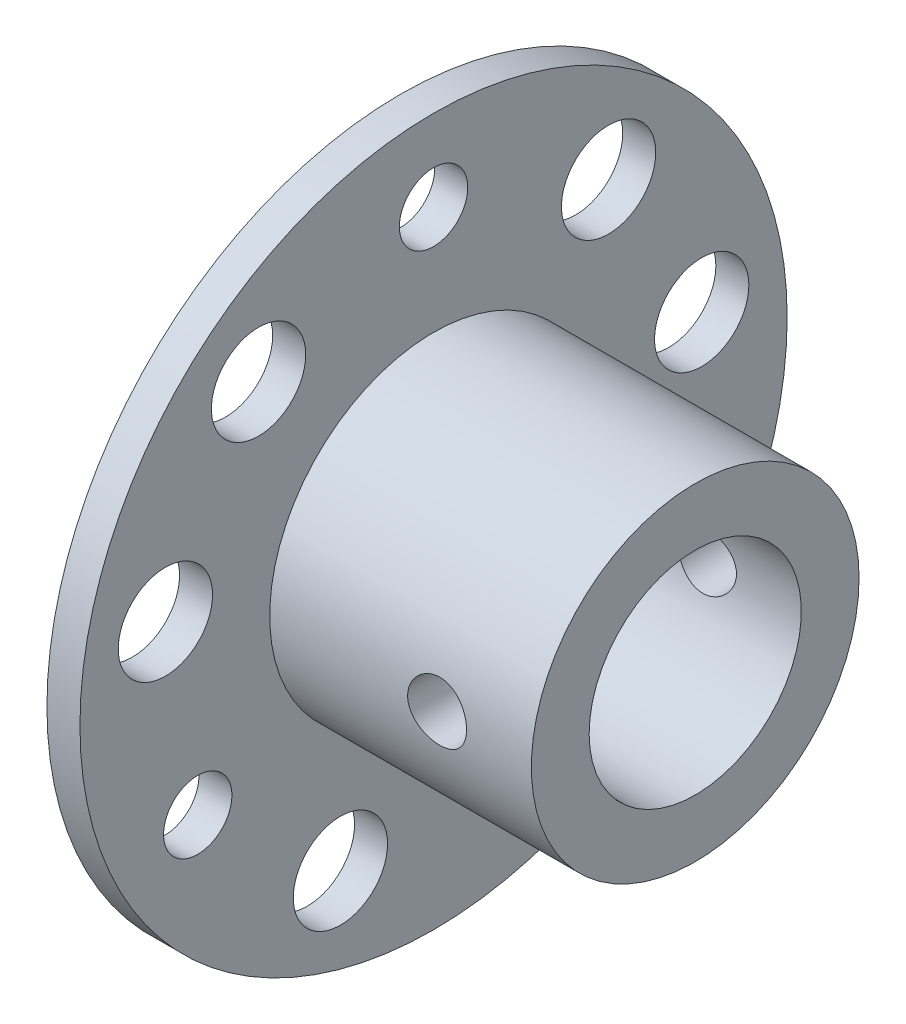
ISO-10303-21;
HEADER;
FILE_DESCRIPTION(('STEP AP214'),'2;1');
FILE_NAME('part.step','',(''),(''),'','','');
FILE_SCHEMA(('AUTOMOTIVE_DESIGN { 1 0 10303 214 1 1 1 1 }'));
ENDSEC;
DATA;
#1=APPLICATION_CONTEXT('core data for automotive mechanical design processes');
#2=APPLICATION_PROTOCOL_DEFINITION('international standard','automotive_design',2000,#1);
#3=PRODUCT_CONTEXT('',#1,'mechanical');
#4=PRODUCT('Part','Part','',(#3));
#5=PRODUCT_RELATED_PRODUCT_CATEGORY('part','',(#4));
#6=PRODUCT_DEFINITION_FORMATION('','',#4);
#7=PRODUCT_DEFINITION_CONTEXT('part definition',#1,'design');
#8=PRODUCT_DEFINITION('design','',#6,#7);
#9=PRODUCT_DEFINITION_SHAPE('','',#8);
#10=(LENGTH_UNIT() NAMED_UNIT(*) SI_UNIT(.MILLI.,.METRE.));
#11=(NAMED_UNIT(*) PLANE_ANGLE_UNIT() SI_UNIT($,.RADIAN.));
#12=(NAMED_UNIT(*) SI_UNIT($,.STERADIAN.) SOLID_ANGLE_UNIT());
#13=UNCERTAINTY_MEASURE_WITH_UNIT(LENGTH_MEASURE(1.E-05),#10,'distance_accuracy_value','');
#14=(GEOMETRIC_REPRESENTATION_CONTEXT(3) GLOBAL_UNCERTAINTY_ASSIGNED_CONTEXT((#13)) GLOBAL_UNIT_ASSIGNED_CONTEXT((#10,
#11,#12)) REPRESENTATION_CONTEXT('',''));
#15=CARTESIAN_POINT('',(0.,0.,0.));
#16=DIRECTION('',(0.,0.,1.));
#17=DIRECTION('',(1.,0.,0.));
#18=AXIS2_PLACEMENT_3D('',#15,#16,#17);
#19=CARTESIAN_POINT('',(1.4,0.,0.));
#20=DIRECTION('',(1.,0.,0.));
#21=DIRECTION('',(0.,0.,-1.));
#22=AXIS2_PLACEMENT_3D('',#19,#20,#21);
#23=PLANE('',#22);
#24=CARTESIAN_POINT('',(1.4,11.55,0.));
#25=DIRECTION('',(1.,0.,0.));
#26=DIRECTION('',(0.,0.,-1.));
#27=AXIS2_PLACEMENT_3D('',#24,#25,#26);
#28=CIRCLE('',#27,1.44999999999999);
#29=CARTESIAN_POINT('',(1.4,11.55,-1.44999999999999));
#30=VERTEX_POINT('',#29);
#31=EDGE_CURVE('E196',#30,#30,#28,.T.);
#32=ORIENTED_EDGE('',*,*,#31,.F.);
#33=EDGE_LOOP('',(#32));
#34=FACE_BOUND('',#33,.T.);
#35=CARTESIAN_POINT('',(1.4,-5.775,10.00259341371));
#36=DIRECTION('',(1.,0.,0.));
#37=DIRECTION('',(0.,0.,-1.));
#38=AXIS2_PLACEMENT_3D('',#35,#36,#37);
#39=CIRCLE('',#38,1.44999999999999);
#40=CARTESIAN_POINT('',(1.4,-5.775,8.55259341371001));
#41=VERTEX_POINT('',#40);
#42=EDGE_CURVE('E192',#41,#41,#39,.T.);
#43=ORIENTED_EDGE('',*,*,#42,.F.);
#44=EDGE_LOOP('',(#43));
#45=FACE_BOUND('',#44,.T.);
#46=CARTESIAN_POINT('',(1.4,-5.775,-10.00259341371));
#47=DIRECTION('',(1.,0.,0.));
#48=DIRECTION('',(0.,0.,-1.));
#49=AXIS2_PLACEMENT_3D('',#46,#47,#48);
#50=CIRCLE('',#49,1.44999999999999);
#51=CARTESIAN_POINT('',(1.4,-5.775,-11.45259341371));
#52=VERTEX_POINT('',#51);
#53=EDGE_CURVE('E188',#52,#52,#50,.T.);
#54=ORIENTED_EDGE('',*,*,#53,.F.);
#55=EDGE_LOOP('',(#54));
#56=FACE_BOUND('',#55,.T.);
#57=CARTESIAN_POINT('',(1.4,8.847813318024,7.42419689188));
#58=DIRECTION('',(1.,0.,0.));
#59=DIRECTION('',(0.,0.,-1.));
#60=AXIS2_PLACEMENT_3D('',#57,#58,#59);
#61=CIRCLE('',#60,1.99999999999999);
#62=CARTESIAN_POINT('',(1.4,8.847813318024,5.42419689188001));
#63=VERTEX_POINT('',#62);
#64=EDGE_CURVE('E184',#63,#63,#61,.T.);
#65=ORIENTED_EDGE('',*,*,#64,.F.);
#66=EDGE_LOOP('',(#65));
#67=FACE_BOUND('',#66,.T.);
#68=CARTESIAN_POINT('',(1.4,2.005636452053,11.37452954729));
#69=DIRECTION('',(1.,0.,0.));
#70=DIRECTION('',(0.,0.,-1.));
#71=AXIS2_PLACEMENT_3D('',#68,#69,#70);
#72=CIRCLE('',#71,1.99999999999999);
#73=CARTESIAN_POINT('',(1.4,2.005636452053,9.37452954729001));
#74=VERTEX_POINT('',#73);
#75=EDGE_CURVE('E180',#74,#74,#72,.T.);
#76=ORIENTED_EDGE('',*,*,#75,.F.);
#77=EDGE_LOOP('',(#76));
#78=FACE_BOUND('',#77,.T.);
#79=CARTESIAN_POINT('',(1.4,-10.85344977008,3.950332655411));
#80=DIRECTION('',(1.,0.,0.));
#81=DIRECTION('',(0.,0.,-1.));
#82=AXIS2_PLACEMENT_3D('',#79,#80,#81);
#83=CIRCLE('',#82,1.99999999999999);
#84=CARTESIAN_POINT('',(1.4,-10.85344977008,1.95033265541101));
#85=VERTEX_POINT('',#84);
#86=EDGE_CURVE('E176',#85,#85,#83,.T.);
#87=ORIENTED_EDGE('',*,*,#86,.F.);
#88=EDGE_LOOP('',(#87));
#89=FACE_BOUND('',#88,.T.);
#90=CARTESIAN_POINT('',(1.4,-10.85344977008,-3.950332655411));
#91=DIRECTION('',(1.,0.,0.));
#92=DIRECTION('',(0.,0.,-1.));
#93=AXIS2_PLACEMENT_3D('',#90,#91,#92);
#94=CIRCLE('',#93,1.99999999999999);
#95=CARTESIAN_POINT('',(1.4,-10.85344977008,-5.95033265541099));
#96=VERTEX_POINT('',#95);
#97=EDGE_CURVE('E172',#96,#96,#94,.T.);
#98=ORIENTED_EDGE('',*,*,#97,.F.);
#99=EDGE_LOOP('',(#98));
#100=FACE_BOUND('',#99,.T.);
#101=CARTESIAN_POINT('',(1.4,2.005636452053,-11.37452954729));
#102=DIRECTION('',(1.,0.,0.));
#103=DIRECTION('',(0.,0.,-1.));
#104=AXIS2_PLACEMENT_3D('',#101,#102,#103);
#105=CIRCLE('',#104,1.99999999999999);
#106=CARTESIAN_POINT('',(1.4,2.005636452053,-13.37452954729));
#107=VERTEX_POINT('',#106);
#108=EDGE_CURVE('E168',#107,#107,#105,.T.);
#109=ORIENTED_EDGE('',*,*,#108,.F.);
#110=EDGE_LOOP('',(#109));
#111=FACE_BOUND('',#110,.T.);
#112=CARTESIAN_POINT('',(1.4,8.847813318024,-7.42419689188));
#113=DIRECTION('',(1.,0.,0.));
#114=DIRECTION('',(0.,0.,-1.));
#115=AXIS2_PLACEMENT_3D('',#112,#113,#114);
#116=CIRCLE('',#115,1.99999999999999);
#117=CARTESIAN_POINT('',(1.4,8.847813318024,-9.42419689187999));
#118=VERTEX_POINT('',#117);
#119=EDGE_CURVE('E164',#118,#118,#116,.T.);
#120=ORIENTED_EDGE('',*,*,#119,.F.);
#121=EDGE_LOOP('',(#120));
#122=FACE_BOUND('',#121,.T.);
#123=CARTESIAN_POINT('',(1.4,0.,0.));
#124=DIRECTION('',(1.,0.,0.));
#125=DIRECTION('',(0.,0.,-1.));
#126=AXIS2_PLACEMENT_3D('',#123,#124,#125);
#127=CIRCLE('',#126,15.);
#128=CARTESIAN_POINT('',(1.4,0.,-15.));
#129=VERTEX_POINT('',#128);
#130=EDGE_CURVE('E65',#129,#129,#127,.T.);
#131=ORIENTED_EDGE('',*,*,#130,.T.);
#132=EDGE_LOOP('',(#131));
#133=FACE_BOUND('',#132,.T.);
#134=CARTESIAN_POINT('',(1.4,0.,0.));
#135=DIRECTION('',(1.,0.,0.));
#136=DIRECTION('',(0.,0.,-1.));
#137=AXIS2_PLACEMENT_3D('',#134,#135,#136);
#138=CIRCLE('',#137,6.95);
#139=CARTESIAN_POINT('',(1.4,0.,-6.95));
#140=VERTEX_POINT('',#139);
#141=EDGE_CURVE('E158',#140,#140,#138,.T.);
#142=ORIENTED_EDGE('',*,*,#141,.F.);
#143=EDGE_LOOP('',(#142));
#144=FACE_BOUND('',#143,.T.);
#145=ADVANCED_FACE('F46',(#34,#45,#56,#67,#78,#89,#100,#111,#122,#133,#144),#23,.T.);
#146=CARTESIAN_POINT('',(0.,0.,0.));
#147=DIRECTION('',(1.,0.,0.));
#148=DIRECTION('',(0.,0.,-1.));
#149=AXIS2_PLACEMENT_3D('',#146,#147,#148);
#150=CYLINDRICAL_SURFACE('',#149,15.);
#151=CARTESIAN_POINT('',(0.,0.,0.));
#152=DIRECTION('',(1.,0.,0.));
#153=DIRECTION('',(0.,0.,-1.));
#154=AXIS2_PLACEMENT_3D('',#151,#152,#153);
#155=CIRCLE('',#154,15.);
#156=CARTESIAN_POINT('',(0.,0.,-15.));
#157=VERTEX_POINT('',#156);
#158=EDGE_CURVE('E61',#157,#157,#155,.T.);
#159=ORIENTED_EDGE('',*,*,#158,.T.);
#160=EDGE_LOOP('',(#159));
#161=FACE_BOUND('',#160,.T.);
#162=ORIENTED_EDGE('',*,*,#130,.F.);
#163=EDGE_LOOP('',(#162));
#164=FACE_BOUND('',#163,.T.);
#165=ADVANCED_FACE('F48',(#161,#164),#150,.T.);
#166=CARTESIAN_POINT('',(0.,15.,0.));
#167=DIRECTION('',(-1.,0.,0.));
#168=DIRECTION('',(0.,0.,1.));
#169=AXIS2_PLACEMENT_3D('',#166,#167,#168);
#170=PLANE('',#169);
#171=CARTESIAN_POINT('',(0.,0.,0.));
#172=DIRECTION('',(-1.,0.,0.));
#173=DIRECTION('',(0.,0.,1.));
#174=AXIS2_PLACEMENT_3D('',#171,#172,#173);
#175=CIRCLE('',#174,4.49999999999999);
#176=CARTESIAN_POINT('',(0.,0.,4.49999999999999));
#177=VERTEX_POINT('',#176);
#178=EDGE_CURVE('E89',#177,#177,#175,.T.);
#179=ORIENTED_EDGE('',*,*,#178,.F.);
#180=EDGE_LOOP('',(#179));
#181=FACE_BOUND('',#180,.T.);
#182=CARTESIAN_POINT('',(0.,11.55,0.));
#183=DIRECTION('',(1.,0.,0.));
#184=DIRECTION('',(0.,0.,-1.));
#185=AXIS2_PLACEMENT_3D('',#182,#183,#184);
#186=CIRCLE('',#185,1.44999999999999);
#187=CARTESIAN_POINT('',(0.,11.55,-1.44999999999999));
#188=VERTEX_POINT('',#187);
#189=EDGE_CURVE('E118',#188,#188,#186,.T.);
#190=ORIENTED_EDGE('',*,*,#189,.T.);
#191=EDGE_LOOP('',(#190));
#192=FACE_BOUND('',#191,.T.);
#193=CARTESIAN_POINT('',(0.,-5.775,10.00259341371));
#194=DIRECTION('',(1.,0.,0.));
#195=DIRECTION('',(0.,0.,-1.));
#196=AXIS2_PLACEMENT_3D('',#193,#194,#195);
#197=CIRCLE('',#196,1.44999999999999);
#198=CARTESIAN_POINT('',(0.,-5.775,8.55259341371001));
#199=VERTEX_POINT('',#198);
#200=EDGE_CURVE('E122',#199,#199,#197,.T.);
#201=ORIENTED_EDGE('',*,*,#200,.T.);
#202=EDGE_LOOP('',(#201));
#203=FACE_BOUND('',#202,.T.);
#204=CARTESIAN_POINT('',(0.,-5.775,-10.00259341371));
#205=DIRECTION('',(1.,0.,0.));
#206=DIRECTION('',(0.,0.,-1.));
#207=AXIS2_PLACEMENT_3D('',#204,#205,#206);
#208=CIRCLE('',#207,1.44999999999999);
#209=CARTESIAN_POINT('',(0.,-5.775,-11.45259341371));
#210=VERTEX_POINT('',#209);
#211=EDGE_CURVE('E126',#210,#210,#208,.T.);
#212=ORIENTED_EDGE('',*,*,#211,.T.);
#213=EDGE_LOOP('',(#212));
#214=FACE_BOUND('',#213,.T.);
#215=CARTESIAN_POINT('',(0.,8.847813318024,7.42419689188));
#216=DIRECTION('',(1.,0.,0.));
#217=DIRECTION('',(0.,0.,-1.));
#218=AXIS2_PLACEMENT_3D('',#215,#216,#217);
#219=CIRCLE('',#218,1.99999999999999);
#220=CARTESIAN_POINT('',(0.,8.847813318024,5.42419689188001));
#221=VERTEX_POINT('',#220);
#222=EDGE_CURVE('E130',#221,#221,#219,.T.);
#223=ORIENTED_EDGE('',*,*,#222,.T.);
#224=EDGE_LOOP('',(#223));
#225=FACE_BOUND('',#224,.T.);
#226=CARTESIAN_POINT('',(0.,2.005636452053,11.37452954729));
#227=DIRECTION('',(1.,0.,0.));
#228=DIRECTION('',(0.,0.,-1.));
#229=AXIS2_PLACEMENT_3D('',#226,#227,#228);
#230=CIRCLE('',#229,1.99999999999999);
#231=CARTESIAN_POINT('',(0.,2.005636452053,9.37452954729001));
#232=VERTEX_POINT('',#231);
#233=EDGE_CURVE('E134',#232,#232,#230,.T.);
#234=ORIENTED_EDGE('',*,*,#233,.T.);
#235=EDGE_LOOP('',(#234));
#236=FACE_BOUND('',#235,.T.);
#237=CARTESIAN_POINT('',(0.,-10.85344977008,3.950332655411));
#238=DIRECTION('',(1.,0.,0.));
#239=DIRECTION('',(0.,0.,-1.));
#240=AXIS2_PLACEMENT_3D('',#237,#238,#239);
#241=CIRCLE('',#240,1.99999999999999);
#242=CARTESIAN_POINT('',(0.,-10.85344977008,1.95033265541101));
#243=VERTEX_POINT('',#242);
#244=EDGE_CURVE('E138',#243,#243,#241,.T.);
#245=ORIENTED_EDGE('',*,*,#244,.T.);
#246=EDGE_LOOP('',(#245));
#247=FACE_BOUND('',#246,.T.);
#248=CARTESIAN_POINT('',(0.,-10.85344977008,-3.950332655411));
#249=DIRECTION('',(1.,0.,0.));
#250=DIRECTION('',(0.,0.,-1.));
#251=AXIS2_PLACEMENT_3D('',#248,#249,#250);
#252=CIRCLE('',#251,1.99999999999999);
#253=CARTESIAN_POINT('',(0.,-10.85344977008,-5.95033265541099));
#254=VERTEX_POINT('',#253);
#255=EDGE_CURVE('E142',#254,#254,#252,.T.);
#256=ORIENTED_EDGE('',*,*,#255,.T.);
#257=EDGE_LOOP('',(#256));
#258=FACE_BOUND('',#257,.T.);
#259=CARTESIAN_POINT('',(0.,2.005636452053,-11.37452954729));
#260=DIRECTION('',(1.,0.,0.));
#261=DIRECTION('',(0.,0.,-1.));
#262=AXIS2_PLACEMENT_3D('',#259,#260,#261);
#263=CIRCLE('',#262,1.99999999999999);
#264=CARTESIAN_POINT('',(0.,2.005636452053,-13.37452954729));
#265=VERTEX_POINT('',#264);
#266=EDGE_CURVE('E146',#265,#265,#263,.T.);
#267=ORIENTED_EDGE('',*,*,#266,.T.);
#268=EDGE_LOOP('',(#267));
#269=FACE_BOUND('',#268,.T.);
#270=CARTESIAN_POINT('',(0.,8.847813318024,-7.42419689188));
#271=DIRECTION('',(1.,0.,0.));
#272=DIRECTION('',(0.,0.,-1.));
#273=AXIS2_PLACEMENT_3D('',#270,#271,#272);
#274=CIRCLE('',#273,1.99999999999999);
#275=CARTESIAN_POINT('',(0.,8.847813318024,-9.42419689187999));
#276=VERTEX_POINT('',#275);
#277=EDGE_CURVE('E150',#276,#276,#274,.T.);
#278=ORIENTED_EDGE('',*,*,#277,.T.);
#279=EDGE_LOOP('',(#278));
#280=FACE_BOUND('',#279,.T.);
#281=ORIENTED_EDGE('',*,*,#158,.F.);
#282=EDGE_LOOP('',(#281));
#283=FACE_BOUND('',#282,.T.);
#284=ADVANCED_FACE('F100',(#181,#192,#203,#214,#225,#236,#247,#258,#269,#280,#283),#170,.T.);
#285=CARTESIAN_POINT('',(12.5,0.,0.));
#286=DIRECTION('',(-1.,0.,0.));
#287=DIRECTION('',(0.,0.,1.));
#288=AXIS2_PLACEMENT_3D('',#285,#286,#287);
#289=CYLINDRICAL_SURFACE('',#288,6.95);
#290=CARTESIAN_POINT('',(9.74999999999999,0.,6.95));
#291=CARTESIAN_POINT('',(9.74999728734122,-0.0696113302434535,6.94999876013842));
#292=CARTESIAN_POINT('',(9.74416546705207,-0.139258559443203,6.94894332261449));
#293=CARTESIAN_POINT('',(9.72100526546777,-0.27659390359982,6.9448346643002));
#294=CARTESIAN_POINT('',(9.703666850945,-0.34428025495703,6.94177970004535));
#295=CARTESIAN_POINT('',(9.65803865004564,-0.47568750794895,6.93401407431002));
#296=CARTESIAN_POINT('',(9.62975840191487,-0.539411807392247,6.92930485520953));
#297=CARTESIAN_POINT('',(9.56307560381576,-0.661204294078777,6.91874630645347));
#298=CARTESIAN_POINT('',(9.52467400079876,-0.719273009761257,6.9128970834697));
#299=CARTESIAN_POINT('',(9.43838735888822,-0.828754949876796,6.90063287168523));
#300=CARTESIAN_POINT('',(9.39041216173338,-0.880096561429369,6.89421285322907));
#301=CARTESIAN_POINT('',(9.28653417008486,-0.974047715658822,6.88156839516824));
#302=CARTESIAN_POINT('',(9.23063083372452,-1.01665666099468,6.87534396896732));
#303=CARTESIAN_POINT('',(9.11198268586216,-1.09222673635356,6.86374664758885));
#304=CARTESIAN_POINT('',(9.04919127372836,-1.12511578499752,6.85838024355784));
#305=CARTESIAN_POINT('',(8.91886197944332,-1.17985122109729,6.84917705551143));
#306=CARTESIAN_POINT('',(8.85132447304917,-1.20169848163253,6.84534015056289));
#307=CARTESIAN_POINT('',(8.71418376438288,-1.23350192185564,6.83968082012216));
#308=CARTESIAN_POINT('',(8.64461030335095,-1.24358252855594,6.83783733079303));
#309=CARTESIAN_POINT('',(8.50473695389707,-1.25195256374057,6.83630997782785));
#310=CARTESIAN_POINT('',(8.43443712584406,-1.25024296437171,6.83662593613721));
#311=CARTESIAN_POINT('',(8.29600298965645,-1.23518218322681,6.83936258029243));
#312=CARTESIAN_POINT('',(8.2278527825425,-1.22197183373534,6.84175780351257));
#313=CARTESIAN_POINT('',(8.09475202937683,-1.18450604050575,6.84834315480548));
#314=CARTESIAN_POINT('',(8.02980160950601,-1.16025016158219,6.85253335359854));
#315=CARTESIAN_POINT('',(7.90452844786081,-1.10124220503819,6.86226348238145));
#316=CARTESIAN_POINT('',(7.8442333751758,-1.06643264964366,6.86781077061702));
#317=CARTESIAN_POINT('',(7.73028685193941,-0.987346164462972,6.87962508428744));
#318=CARTESIAN_POINT('',(7.67663602413515,-0.943068348301205,6.88589217708167));
#319=CARTESIAN_POINT('',(7.57668666327938,-0.845539869554003,6.89855126400262));
#320=CARTESIAN_POINT('',(7.53050579420413,-0.792168603833522,6.90494375297045));
#321=CARTESIAN_POINT('',(7.44773603398818,-0.678373437296191,6.91704981188085));
#322=CARTESIAN_POINT('',(7.41114722501453,-0.617949476071282,6.92276337600741));
#323=CARTESIAN_POINT('',(7.34858540710761,-0.491646001936782,6.93287799742564));
#324=CARTESIAN_POINT('',(7.32262393428211,-0.425760653386525,6.93727762703165));
#325=CARTESIAN_POINT('',(7.28216897446972,-0.290467655364094,6.94425748301466));
#326=CARTESIAN_POINT('',(7.26767436798108,-0.221060350442172,6.94683788699865));
#327=CARTESIAN_POINT('',(7.25072674116283,-0.0817066601396642,6.94986434984093));
#328=CARTESIAN_POINT('',(7.24811238687955,-0.0117804958092556,6.95033900270349));
#329=CARTESIAN_POINT('',(7.25456771769269,0.127510094163503,6.94917921413047));
#330=CARTESIAN_POINT('',(7.26363687633412,0.196874544974749,6.94754486772565));
#331=CARTESIAN_POINT('',(7.29306762862916,0.332566065115866,6.94236848068303));
#332=CARTESIAN_POINT('',(7.31334825573476,0.398911262987345,6.93884012337371));
#333=CARTESIAN_POINT('',(7.36453913119397,0.527259894153127,6.93026968904937));
#334=CARTESIAN_POINT('',(7.39545005535849,0.589263051104636,6.92522751579754));
#335=CARTESIAN_POINT('',(7.46738586657343,0.70786076540318,6.91411749238514));
#336=CARTESIAN_POINT('',(7.50851017159627,0.764394075855201,6.90803975633954));
#337=CARTESIAN_POINT('',(7.59957000739199,0.869815026737472,6.89555979636997));
#338=CARTESIAN_POINT('',(7.64950629090221,0.918702013329491,6.88915754475854));
#339=CARTESIAN_POINT('',(7.7575004544607,1.00804996650856,6.87665617013414));
#340=CARTESIAN_POINT('',(7.81564971418646,1.04840123713693,6.87056168016469));
#341=CARTESIAN_POINT('',(7.93799601132127,1.11876304424492,6.8594564910508));
#342=CARTESIAN_POINT('',(8.00219283551115,1.14877394512162,6.85444575371698));
#343=CARTESIAN_POINT('',(8.13452275409116,1.19744431796043,6.84611116328156));
#344=CARTESIAN_POINT('',(8.20263624617755,1.21615570661058,6.84277960688911));
#345=CARTESIAN_POINT('',(8.34110523804411,1.2418573460418,6.83816231412512));
#346=CARTESIAN_POINT('',(8.41146050648284,1.24884880230201,6.83687636734864));
#347=CARTESIAN_POINT('',(8.55131848683639,1.2508743091154,6.83650596429886));
#348=CARTESIAN_POINT('',(8.6208186701131,1.24608124224601,6.83738967816553));
#349=CARTESIAN_POINT('',(8.75800581353226,1.22505048443179,6.8411887567497));
#350=CARTESIAN_POINT('',(8.825692782513,1.20881284928253,6.84410411156238));
#351=CARTESIAN_POINT('',(8.95724902571925,1.16542431972834,6.85162507235743));
#352=CARTESIAN_POINT('',(9.02112415850391,1.13829069534649,6.85622800255165));
#353=CARTESIAN_POINT('',(9.14344332858959,1.07389884628713,6.86660761685929));
#354=CARTESIAN_POINT('',(9.20188702467568,1.03663998609602,6.87238437464263));
#355=CARTESIAN_POINT('',(9.31255320483866,0.952448171197189,6.88456036259647));
#356=CARTESIAN_POINT('',(9.36467875332863,0.905388861607025,6.89096707997272));
#357=CARTESIAN_POINT('',(9.4603514466961,0.803196743242862,6.90362371600264));
#358=CARTESIAN_POINT('',(9.50389661615256,0.748062080399089,6.90987359826055));
#359=CARTESIAN_POINT('',(9.58150300094453,0.630744933585179,6.92157214670525));
#360=CARTESIAN_POINT('',(9.61548365856862,0.56850844830199,6.92701383496785));
#361=CARTESIAN_POINT('',(9.67245344602343,0.439134256123971,6.93641489727039));
#362=CARTESIAN_POINT('',(9.69545313842268,0.37200133106799,6.94037569497717));
#363=CARTESIAN_POINT('',(9.72501485714689,0.253871645263369,6.94553943350893));
#364=CARTESIAN_POINT('',(9.73436866178123,0.203575100997876,6.94720289369539));
#365=CARTESIAN_POINT('',(9.74686216036661,0.102192142554601,6.94943361996671));
#366=CARTESIAN_POINT('',(9.75000199152133,0.0511057458417527,6.95000091025484));
#367=CARTESIAN_POINT('',(9.74999999999999,0.,6.95));
#368=B_SPLINE_CURVE_WITH_KNOTS('',3,(#290,#291,#292,#293,#294,#295,#296,#297,#298,#299,#300,
#301,#302,#303,#304,#305,#306,#307,#308,#309,#310,#311,#312,#313,#314,#315,#316,#317,#318,#319,
#320,#321,#322,#323,#324,#325,#326,#327,#328,#329,#330,#331,#332,#333,#334,#335,#336,#337,#338,
#339,#340,#341,#342,#343,#344,#345,#346,#347,#348,#349,#350,#351,#352,#353,#354,#355,#356,#357,
#358,#359,#360,#361,#362,#363,#364,#365,#366,#367),.UNSPECIFIED.,.T.,.F.,(4,2,2,2,2,2,2,2,2,2,2,
2,2,2,2,2,2,2,2,2,2,2,2,2,2,2,2,2,2,2,2,2,2,2,2,2,2,2,4),(0.,0.208647128873026,0.41747642802344,
0.626124094577478,0.834752247035276,1.04544667891757,1.25615551813537,1.4683898429068,
1.68060738358297,1.8905598857308,2.10049507671266,2.30789510425558,2.51530330390844,
2.72386203120204,2.93244029137155,3.14403768172437,3.3556368845935,3.56746517583373,
3.77927278388,3.98819527471856,4.19710835191214,4.40453205375358,4.61196894479589,
4.82151013447479,5.031069232266,5.24317671802181,5.45527672829454,5.66639465972747,
5.87749087483351,6.08550877153368,6.29352565409371,6.50121412538059,6.70891563531174,
6.91948217581816,7.13009713759098,7.34243627761411,7.55457075547574,7.70775418909723,
7.86093424041221),.UNSPECIFIED.);
#369=CARTESIAN_POINT('',(9.74999999999999,0.,6.95));
#370=VERTEX_POINT('',#369);
#371=EDGE_CURVE('E90',#370,#370,#368,.T.);
#372=ORIENTED_EDGE('',*,*,#371,.T.);
#373=EDGE_LOOP('',(#372));
#374=FACE_BOUND('',#373,.T.);
#375=CARTESIAN_POINT('',(9.74999999999999,0.,-6.95));
#376=CARTESIAN_POINT('',(9.74999728734122,0.0696113302434533,-6.94999876013842));
#377=CARTESIAN_POINT('',(9.74416546705207,0.139258559443202,-6.94894332261449));
#378=CARTESIAN_POINT('',(9.72100526546777,0.27659390359982,-6.9448346643002));
#379=CARTESIAN_POINT('',(9.703666850945,0.34428025495703,-6.94177970004535));
#380=CARTESIAN_POINT('',(9.65803865004564,0.47568750794895,-6.93401407431002));
#381=CARTESIAN_POINT('',(9.62975840191487,0.539411807392247,-6.92930485520953));
#382=CARTESIAN_POINT('',(9.56307560381576,0.661204294078778,-6.91874630645347));
#383=CARTESIAN_POINT('',(9.52467400079875,0.719273009761257,-6.9128970834697));
#384=CARTESIAN_POINT('',(9.43838735888822,0.828754949876795,-6.90063287168523));
#385=CARTESIAN_POINT('',(9.39041216173337,0.880096561429368,-6.89421285322906));
#386=CARTESIAN_POINT('',(9.28653417008485,0.974047715658821,-6.88156839516823));
#387=CARTESIAN_POINT('',(9.23063083372451,1.01665666099468,-6.87534396896732));
#388=CARTESIAN_POINT('',(9.11198268586216,1.09222673635356,-6.86374664758885));
#389=CARTESIAN_POINT('',(9.04919127372836,1.12511578499751,-6.85838024355784));
#390=CARTESIAN_POINT('',(8.91886197944332,1.17985122109729,-6.84917705551143));
#391=CARTESIAN_POINT('',(8.85132447304917,1.20169848163253,-6.84534015056289));
#392=CARTESIAN_POINT('',(8.71418376438288,1.23350192185564,-6.83968082012216));
#393=CARTESIAN_POINT('',(8.64461030335095,1.24358252855593,-6.83783733079303));
#394=CARTESIAN_POINT('',(8.50473695389707,1.25195256374057,-6.83630997782785));
#395=CARTESIAN_POINT('',(8.43443712584406,1.25024296437171,-6.83662593613721));
#396=CARTESIAN_POINT('',(8.29600298965645,1.2351821832268,-6.83936258029243));
#397=CARTESIAN_POINT('',(8.2278527825425,1.22197183373534,-6.84175780351257));
#398=CARTESIAN_POINT('',(8.09475202937683,1.18450604050575,-6.84834315480548));
#399=CARTESIAN_POINT('',(8.02980160950601,1.16025016158219,-6.85253335359854));
#400=CARTESIAN_POINT('',(7.90452844786081,1.10124220503819,-6.86226348238145));
#401=CARTESIAN_POINT('',(7.8442333751758,1.06643264964366,-6.86781077061702));
#402=CARTESIAN_POINT('',(7.73028685193941,0.987346164462971,-6.87962508428744));
#403=CARTESIAN_POINT('',(7.67663602413515,0.943068348301204,-6.88589217708168));
#404=CARTESIAN_POINT('',(7.57668666327938,0.845539869554002,-6.89855126400262));
#405=CARTESIAN_POINT('',(7.53050579420413,0.792168603833521,-6.90494375297045));
#406=CARTESIAN_POINT('',(7.44773603398818,0.67837343729619,-6.91704981188085));
#407=CARTESIAN_POINT('',(7.41114722501454,0.617949476071282,-6.92276337600741));
#408=CARTESIAN_POINT('',(7.34858540710762,0.491646001936782,-6.93287799742564));
#409=CARTESIAN_POINT('',(7.32262393428211,0.425760653386524,-6.93727762703165));
#410=CARTESIAN_POINT('',(7.28216897446972,0.290467655364094,-6.94425748301466));
#411=CARTESIAN_POINT('',(7.26767436798108,0.221060350442172,-6.94683788699865));
#412=CARTESIAN_POINT('',(7.25072674116283,0.0817066601396642,-6.94986434984093));
#413=CARTESIAN_POINT('',(7.24811238687955,0.0117804958092557,-6.95033900270349));
#414=CARTESIAN_POINT('',(7.25456771769269,-0.127510094163502,-6.94917921413047));
#415=CARTESIAN_POINT('',(7.26363687633412,-0.196874544974749,-6.94754486772565));
#416=CARTESIAN_POINT('',(7.29306762862916,-0.332566065115865,-6.94236848068303));
#417=CARTESIAN_POINT('',(7.31334825573476,-0.398911262987344,-6.93884012337371));
#418=CARTESIAN_POINT('',(7.36453913119397,-0.527259894153126,-6.93026968904937));
#419=CARTESIAN_POINT('',(7.3954500553585,-0.589263051104635,-6.92522751579754));
#420=CARTESIAN_POINT('',(7.46738586657343,-0.707860765403178,-6.91411749238514));
#421=CARTESIAN_POINT('',(7.50851017159627,-0.764394075855199,-6.90803975633954));
#422=CARTESIAN_POINT('',(7.59957000739199,-0.869815026737471,-6.89555979636997));
#423=CARTESIAN_POINT('',(7.64950629090221,-0.918702013329489,-6.88915754475854));
#424=CARTESIAN_POINT('',(7.7575004544607,-1.00804996650855,-6.87665617013414));
#425=CARTESIAN_POINT('',(7.81564971418647,-1.04840123713693,-6.87056168016469));
#426=CARTESIAN_POINT('',(7.93799601132128,-1.11876304424492,-6.8594564910508));
#427=CARTESIAN_POINT('',(8.00219283551116,-1.14877394512162,-6.85444575371698));
#428=CARTESIAN_POINT('',(8.13452275409116,-1.19744431796043,-6.84611116328156));
#429=CARTESIAN_POINT('',(8.20263624617755,-1.21615570661058,-6.84277960688911));
#430=CARTESIAN_POINT('',(8.34110523804411,-1.24185734604179,-6.83816231412512));
#431=CARTESIAN_POINT('',(8.41146050648284,-1.24884880230201,-6.83687636734864));
#432=CARTESIAN_POINT('',(8.55131848683639,-1.2508743091154,-6.83650596429886));
#433=CARTESIAN_POINT('',(8.62081867011309,-1.246081242246,-6.83738967816553));
#434=CARTESIAN_POINT('',(8.75800581353226,-1.22505048443179,-6.8411887567497));
#435=CARTESIAN_POINT('',(8.825692782513,-1.20881284928253,-6.84410411156238));
#436=CARTESIAN_POINT('',(8.95724902571925,-1.16542431972834,-6.85162507235743));
#437=CARTESIAN_POINT('',(9.02112415850391,-1.13829069534648,-6.85622800255165));
#438=CARTESIAN_POINT('',(9.14344332858959,-1.07389884628713,-6.86660761685929));
#439=CARTESIAN_POINT('',(9.20188702467568,-1.03663998609602,-6.87238437464263));
#440=CARTESIAN_POINT('',(9.31255320483866,-0.952448171197188,-6.88456036259647));
#441=CARTESIAN_POINT('',(9.36467875332863,-0.905388861607024,-6.89096707997272));
#442=CARTESIAN_POINT('',(9.4603514466961,-0.803196743242861,-6.90362371600264));
#443=CARTESIAN_POINT('',(9.50389661615256,-0.748062080399088,-6.90987359826055));
#444=CARTESIAN_POINT('',(9.58150300094453,-0.630744933585179,-6.92157214670525));
#445=CARTESIAN_POINT('',(9.61548365856862,-0.568508448301989,-6.92701383496785));
#446=CARTESIAN_POINT('',(9.67245344602343,-0.43913425612397,-6.93641489727039));
#447=CARTESIAN_POINT('',(9.69545313842268,-0.372001331067988,-6.94037569497717));
#448=CARTESIAN_POINT('',(9.72501485714688,-0.253871645263368,-6.94553943350893));
#449=CARTESIAN_POINT('',(9.73436866178122,-0.203575100997875,-6.94720289369539));
#450=CARTESIAN_POINT('',(9.74686216036661,-0.1021921425546,-6.94943361996671));
#451=CARTESIAN_POINT('',(9.75000199152133,-0.0511057458417523,-6.95000091025484));
#452=CARTESIAN_POINT('',(9.74999999999999,0.,-6.95));
#453=B_SPLINE_CURVE_WITH_KNOTS('',3,(#375,#376,#377,#378,#379,#380,#381,#382,#383,#384,#385,
#386,#387,#388,#389,#390,#391,#392,#393,#394,#395,#396,#397,#398,#399,#400,#401,#402,#403,#404,
#405,#406,#407,#408,#409,#410,#411,#412,#413,#414,#415,#416,#417,#418,#419,#420,#421,#422,#423,
#424,#425,#426,#427,#428,#429,#430,#431,#432,#433,#434,#435,#436,#437,#438,#439,#440,#441,#442,
#443,#444,#445,#446,#447,#448,#449,#450,#451,#452),.UNSPECIFIED.,.T.,.F.,(4,2,2,2,2,2,2,2,2,2,2,
2,2,2,2,2,2,2,2,2,2,2,2,2,2,2,2,2,2,2,2,2,2,2,2,2,2,2,4),(0.,0.208647128873026,0.41747642802344,
0.626124094577479,0.834752247035276,1.04544667891757,1.25615551813537,1.4683898429068,
1.68060738358296,1.8905598857308,2.10049507671266,2.30789510425558,2.51530330390844,
2.72386203120203,2.93244029137154,3.14403768172436,3.3556368845935,3.56746517583372,
3.77927278387999,3.98819527471855,4.19710835191214,4.40453205375357,4.61196894479588,
4.82151013447479,5.031069232266,5.2431767180218,5.45527672829453,5.66639465972746,
5.87749087483351,6.08550877153367,6.2935256540937,6.50121412538058,6.70891563531173,
6.91948217581815,7.13009713759096,7.3424362776141,7.55457075547573,7.70775418909722,
7.8609342404122),.UNSPECIFIED.);
#454=CARTESIAN_POINT('',(9.74999999999999,0.,-6.95));
#455=VERTEX_POINT('',#454);
#456=EDGE_CURVE('E82',#455,#455,#453,.T.);
#457=ORIENTED_EDGE('',*,*,#456,.T.);
#458=EDGE_LOOP('',(#457));
#459=FACE_BOUND('',#458,.T.);
#460=CARTESIAN_POINT('',(12.5,0.,0.));
#461=DIRECTION('',(1.,0.,0.));
#462=DIRECTION('',(0.,0.,-1.));
#463=AXIS2_PLACEMENT_3D('',#460,#461,#462);
#464=CIRCLE('',#463,6.95);
#465=CARTESIAN_POINT('',(12.5,0.,-6.95));
#466=VERTEX_POINT('',#465);
#467=EDGE_CURVE('E156',#466,#466,#464,.T.);
#468=ORIENTED_EDGE('',*,*,#467,.F.);
#469=EDGE_LOOP('',(#468));
#470=FACE_BOUND('',#469,.T.);
#471=ORIENTED_EDGE('',*,*,#141,.T.);
#472=EDGE_LOOP('',(#471));
#473=FACE_BOUND('',#472,.T.);
#474=ADVANCED_FACE('F94',(#374,#459,#470,#473),#289,.T.);
#475=CARTESIAN_POINT('',(12.5,0.,0.));
#476=DIRECTION('',(1.,0.,0.));
#477=DIRECTION('',(0.,0.,-1.));
#478=AXIS2_PLACEMENT_3D('',#475,#476,#477);
#479=PLANE('',#478);
#480=CARTESIAN_POINT('',(12.5,0.,0.));
#481=DIRECTION('',(-1.,0.,0.));
#482=DIRECTION('',(0.,0.,1.));
#483=AXIS2_PLACEMENT_3D('',#480,#481,#482);
#484=CIRCLE('',#483,4.49999999999999);
#485=CARTESIAN_POINT('',(12.5,0.,4.49999999999999));
#486=VERTEX_POINT('',#485);
#487=EDGE_CURVE('E198',#486,#486,#484,.T.);
#488=ORIENTED_EDGE('',*,*,#487,.T.);
#489=EDGE_LOOP('',(#488));
#490=FACE_BOUND('',#489,.T.);
#491=ORIENTED_EDGE('',*,*,#467,.T.);
#492=EDGE_LOOP('',(#491));
#493=FACE_BOUND('',#492,.T.);
#494=ADVANCED_FACE('F99',(#490,#493),#479,.T.);
#495=CARTESIAN_POINT('',(1.4,8.847813318024,-7.42419689188));
#496=DIRECTION('',(1.,0.,0.));
#497=DIRECTION('',(0.,0.,-1.));
#498=AXIS2_PLACEMENT_3D('',#495,#496,#497);
#499=CYLINDRICAL_SURFACE('',#498,1.99999999999999);
#500=ORIENTED_EDGE('',*,*,#277,.F.);
#501=EDGE_LOOP('',(#500));
#502=FACE_BOUND('',#501,.T.);
#503=ORIENTED_EDGE('',*,*,#119,.T.);
#504=EDGE_LOOP('',(#503));
#505=FACE_BOUND('',#504,.T.);
#506=ADVANCED_FACE('F240',(#502,#505),#499,.F.);
#507=CARTESIAN_POINT('',(1.4,2.005636452053,-11.37452954729));
#508=DIRECTION('',(1.,0.,0.));
#509=DIRECTION('',(0.,0.,-1.));
#510=AXIS2_PLACEMENT_3D('',#507,#508,#509);
#511=CYLINDRICAL_SURFACE('',#510,1.99999999999999);
#512=ORIENTED_EDGE('',*,*,#266,.F.);
#513=EDGE_LOOP('',(#512));
#514=FACE_BOUND('',#513,.T.);
#515=ORIENTED_EDGE('',*,*,#108,.T.);
#516=EDGE_LOOP('',(#515));
#517=FACE_BOUND('',#516,.T.);
#518=ADVANCED_FACE('F237',(#514,#517),#511,.F.);
#519=CARTESIAN_POINT('',(1.4,-10.85344977008,-3.950332655411));
#520=DIRECTION('',(1.,0.,0.));
#521=DIRECTION('',(0.,0.,-1.));
#522=AXIS2_PLACEMENT_3D('',#519,#520,#521);
#523=CYLINDRICAL_SURFACE('',#522,1.99999999999999);
#524=ORIENTED_EDGE('',*,*,#255,.F.);
#525=EDGE_LOOP('',(#524));
#526=FACE_BOUND('',#525,.T.);
#527=ORIENTED_EDGE('',*,*,#97,.T.);
#528=EDGE_LOOP('',(#527));
#529=FACE_BOUND('',#528,.T.);
#530=ADVANCED_FACE('F233',(#526,#529),#523,.F.);
#531=CARTESIAN_POINT('',(1.4,-10.85344977008,3.950332655411));
#532=DIRECTION('',(1.,0.,0.));
#533=DIRECTION('',(0.,0.,-1.));
#534=AXIS2_PLACEMENT_3D('',#531,#532,#533);
#535=CYLINDRICAL_SURFACE('',#534,1.99999999999999);
#536=ORIENTED_EDGE('',*,*,#244,.F.);
#537=EDGE_LOOP('',(#536));
#538=FACE_BOUND('',#537,.T.);
#539=ORIENTED_EDGE('',*,*,#86,.T.);
#540=EDGE_LOOP('',(#539));
#541=FACE_BOUND('',#540,.T.);
#542=ADVANCED_FACE('F229',(#538,#541),#535,.F.);
#543=CARTESIAN_POINT('',(1.4,2.005636452053,11.37452954729));
#544=DIRECTION('',(1.,0.,0.));
#545=DIRECTION('',(0.,0.,-1.));
#546=AXIS2_PLACEMENT_3D('',#543,#544,#545);
#547=CYLINDRICAL_SURFACE('',#546,1.99999999999999);
#548=ORIENTED_EDGE('',*,*,#233,.F.);
#549=EDGE_LOOP('',(#548));
#550=FACE_BOUND('',#549,.T.);
#551=ORIENTED_EDGE('',*,*,#75,.T.);
#552=EDGE_LOOP('',(#551));
#553=FACE_BOUND('',#552,.T.);
#554=ADVANCED_FACE('F225',(#550,#553),#547,.F.);
#555=CARTESIAN_POINT('',(1.4,8.847813318024,7.42419689188));
#556=DIRECTION('',(1.,0.,0.));
#557=DIRECTION('',(0.,0.,-1.));
#558=AXIS2_PLACEMENT_3D('',#555,#556,#557);
#559=CYLINDRICAL_SURFACE('',#558,1.99999999999999);
#560=ORIENTED_EDGE('',*,*,#222,.F.);
#561=EDGE_LOOP('',(#560));
#562=FACE_BOUND('',#561,.T.);
#563=ORIENTED_EDGE('',*,*,#64,.T.);
#564=EDGE_LOOP('',(#563));
#565=FACE_BOUND('',#564,.T.);
#566=ADVANCED_FACE('F221',(#562,#565),#559,.F.);
#567=CARTESIAN_POINT('',(1.4,-5.775,-10.00259341371));
#568=DIRECTION('',(1.,0.,0.));
#569=DIRECTION('',(0.,0.,-1.));
#570=AXIS2_PLACEMENT_3D('',#567,#568,#569);
#571=CYLINDRICAL_SURFACE('',#570,1.44999999999999);
#572=ORIENTED_EDGE('',*,*,#211,.F.);
#573=EDGE_LOOP('',(#572));
#574=FACE_BOUND('',#573,.T.);
#575=ORIENTED_EDGE('',*,*,#53,.T.);
#576=EDGE_LOOP('',(#575));
#577=FACE_BOUND('',#576,.T.);
#578=ADVANCED_FACE('F214',(#574,#577),#571,.F.);
#579=CARTESIAN_POINT('',(1.4,-5.775,10.00259341371));
#580=DIRECTION('',(1.,0.,0.));
#581=DIRECTION('',(0.,0.,-1.));
#582=AXIS2_PLACEMENT_3D('',#579,#580,#581);
#583=CYLINDRICAL_SURFACE('',#582,1.44999999999999);
#584=ORIENTED_EDGE('',*,*,#200,.F.);
#585=EDGE_LOOP('',(#584));
#586=FACE_BOUND('',#585,.T.);
#587=ORIENTED_EDGE('',*,*,#42,.T.);
#588=EDGE_LOOP('',(#587));
#589=FACE_BOUND('',#588,.T.);
#590=ADVANCED_FACE('F208',(#586,#589),#583,.F.);
#591=CARTESIAN_POINT('',(1.4,11.55,0.));
#592=DIRECTION('',(1.,0.,0.));
#593=DIRECTION('',(0.,0.,-1.));
#594=AXIS2_PLACEMENT_3D('',#591,#592,#593);
#595=CYLINDRICAL_SURFACE('',#594,1.44999999999999);
#596=ORIENTED_EDGE('',*,*,#189,.F.);
#597=EDGE_LOOP('',(#596));
#598=FACE_BOUND('',#597,.T.);
#599=ORIENTED_EDGE('',*,*,#31,.T.);
#600=EDGE_LOOP('',(#599));
#601=FACE_BOUND('',#600,.T.);
#602=ADVANCED_FACE('F204',(#598,#601),#595,.F.);
#603=CARTESIAN_POINT('',(0.,0.,0.));
#604=DIRECTION('',(-1.,0.,0.));
#605=DIRECTION('',(0.,0.,1.));
#606=AXIS2_PLACEMENT_3D('',#603,#604,#605);
#607=CYLINDRICAL_SURFACE('',#606,4.49999999999999);
#608=CARTESIAN_POINT('',(9.74999999999999,0.,4.49999999999999));
#609=CARTESIAN_POINT('',(9.74999860041476,0.0688012508831787,4.49999908016928));
#610=CARTESIAN_POINT('',(9.74430068019469,0.137617123752666,4.49840674086831));
#611=CARTESIAN_POINT('',(9.72170427173467,0.273259475994236,4.49220950198235));
#612=CARTESIAN_POINT('',(9.70480105828627,0.340085103663436,4.48760333149252));
#613=CARTESIAN_POINT('',(9.66039128058606,0.469769949680297,4.47588565394593));
#614=CARTESIAN_POINT('',(9.63289903130157,0.532634390095665,4.46877753030963));
#615=CARTESIAN_POINT('',(9.56814649367312,0.652860695241766,4.45280312581995));
#616=CARTESIAN_POINT('',(9.53088533808073,0.710222070812291,4.44393668888687));
#617=CARTESIAN_POINT('',(9.44667056615713,0.819246784715918,4.42515157817489));
#618=CARTESIAN_POINT('',(9.39951796031245,0.870753112808467,4.41521373623695));
#619=CARTESIAN_POINT('',(9.2972837228784,0.96523818569633,4.39552607117255));
#620=CARTESIAN_POINT('',(9.24220097772476,1.00821573084553,4.38577627467017));
#621=CARTESIAN_POINT('',(9.12439273987068,1.08520808580322,4.36737044294546));
#622=CARTESIAN_POINT('',(9.06154279155628,1.11903874947836,4.35873847945983));
#623=CARTESIAN_POINT('',(8.93076808235988,1.17558957131139,4.34382900808303));
#624=CARTESIAN_POINT('',(8.86284434959184,1.19831197336241,4.33755102474247));
#625=CARTESIAN_POINT('',(8.72559721114587,1.23144924367955,4.32825883142876));
#626=CARTESIAN_POINT('',(8.65634817836012,1.24215036904295,4.32516886003198));
#627=CARTESIAN_POINT('',(8.51697411443717,1.25183427077971,4.32237649384803));
#628=CARTESIAN_POINT('',(8.4468492651188,1.25081944027302,4.32267340725019));
#629=CARTESIAN_POINT('',(8.3099777212773,1.23732671337618,4.32655366801453));
#630=CARTESIAN_POINT('',(8.24319319850379,1.2251990227067,4.33003660668584));
#631=CARTESIAN_POINT('',(8.11264637140841,1.19038731201904,4.33973517053475));
#632=CARTESIAN_POINT('',(8.04888432739775,1.16770238457156,4.3459510306134));
#633=CARTESIAN_POINT('',(7.92529776854473,1.11214373134464,4.36050069775751));
#634=CARTESIAN_POINT('',(7.86553013318995,1.0791502183699,4.36885918600196));
#635=CARTESIAN_POINT('',(7.75225842440876,1.00399440679634,4.38673950684299));
#636=CARTESIAN_POINT('',(7.69875568127387,0.961830166290592,4.39626158564315));
#637=CARTESIAN_POINT('',(7.59753611956359,0.867755610284431,4.41581072126826));
#638=CARTESIAN_POINT('',(7.55009236512016,0.815552279702347,4.4258437003779));
#639=CARTESIAN_POINT('',(7.4645742692222,0.703806607201028,4.44498199810827));
#640=CARTESIAN_POINT('',(7.42650036189753,0.644263925421959,4.4540872737346));
#641=CARTESIAN_POINT('',(7.36066818436994,0.519083429338109,4.47040839712754));
#642=CARTESIAN_POINT('',(7.33296289606111,0.453416395747743,4.47761448645531));
#643=CARTESIAN_POINT('',(7.28906590155864,0.318109988769712,4.48925492501445));
#644=CARTESIAN_POINT('',(7.27287145784344,0.248471564121128,4.49368993323698));
#645=CARTESIAN_POINT('',(7.25289286322104,0.10952660771314,4.49918736483407));
#646=CARTESIAN_POINT('',(7.24873785509285,0.04027730585868,4.50035053824029));
#647=CARTESIAN_POINT('',(7.25192699829244,-0.097929930636567,4.49946480293158));
#648=CARTESIAN_POINT('',(7.25926985164806,-0.166887897284518,4.49741625678166));
#649=CARTESIAN_POINT('',(7.28494333411965,-0.301206913470858,4.49040265059027));
#650=CARTESIAN_POINT('',(7.30306394505753,-0.366611288163864,4.48549337167579));
#651=CARTESIAN_POINT('',(7.34953186763811,-0.493443118118717,4.47331829169353));
#652=CARTESIAN_POINT('',(7.37788033256952,-0.554870123972377,4.46605222488462));
#653=CARTESIAN_POINT('',(7.44466587804651,-0.673420140405411,4.44973740284174));
#654=CARTESIAN_POINT('',(7.48330052432268,-0.730427061953535,4.44065471340564));
#655=CARTESIAN_POINT('',(7.56931613580747,-0.837277670586993,4.42175477128211));
#656=CARTESIAN_POINT('',(7.61669898006577,-0.887119814631368,4.41193736105188));
#657=CARTESIAN_POINT('',(7.72060144387836,-0.979812026944943,4.39229842684378));
#658=CARTESIAN_POINT('',(7.77735745155758,-1.02239957885382,4.38248608207959));
#659=CARTESIAN_POINT('',(7.89742063787974,-1.09745581429007,4.36429693304266));
#660=CARTESIAN_POINT('',(7.9607275658426,-1.12992488482462,4.35592007387162));
#661=CARTESIAN_POINT('',(8.09180716988318,-1.18358105834152,4.34164798956172));
#662=CARTESIAN_POINT('',(8.15955263775464,-1.20483077484782,4.33573903096039));
#663=CARTESIAN_POINT('',(8.29784970941676,-1.23557652495355,4.32707876892783));
#664=CARTESIAN_POINT('',(8.36840051463312,-1.24507587906572,4.32432657344886));
#665=CARTESIAN_POINT('',(8.50760577949078,-1.2518485997432,4.32237038329874));
#666=CARTESIAN_POINT('',(8.57623819001194,-1.24954571014581,4.32304340461176));
#667=CARTESIAN_POINT('',(8.71209489379468,-1.23377143287257,4.32757137052123));
#668=CARTESIAN_POINT('',(8.77931922926823,-1.22030038049409,4.3314262195909));
#669=CARTESIAN_POINT('',(8.90986723391806,-1.18282724248613,4.34180718808002));
#670=CARTESIAN_POINT('',(8.97322084264775,-1.15892214641116,4.34830866913274));
#671=CARTESIAN_POINT('',(9.09506742250732,-1.10133451670733,4.36324916052053));
#672=CARTESIAN_POINT('',(9.15355957148568,-1.06765033358687,4.37168849767403));
#673=CARTESIAN_POINT('',(9.26602765282517,-0.990206962020962,4.38988810785378));
#674=CARTESIAN_POINT('',(9.31980147668272,-0.946162084346256,4.39968178982261));
#675=CARTESIAN_POINT('',(9.41933237205345,-0.849781527450654,4.41930831909361));
#676=CARTESIAN_POINT('',(9.46508745289097,-0.797443795628183,4.4291411755031));
#677=CARTESIAN_POINT('',(9.54835813657807,-0.684460232307874,4.44801839581547));
#678=CARTESIAN_POINT('',(9.58565162331067,-0.623646258932167,4.45703841192791));
#679=CARTESIAN_POINT('',(9.64942813928947,-0.496361982692834,4.47299974900604));
#680=CARTESIAN_POINT('',(9.67591751858101,-0.429895030176718,4.47994229035334));
#681=CARTESIAN_POINT('',(9.71422008073469,-0.303145483766695,4.49016074831949));
#682=CARTESIAN_POINT('',(9.72760478759286,-0.243364402168737,4.49382245661854));
#683=CARTESIAN_POINT('',(9.74549484582253,-0.122392625693407,4.49874234976284));
#684=CARTESIAN_POINT('',(9.75000124499992,-0.0612020980194142,4.50000081823466));
#685=CARTESIAN_POINT('',(9.74999999999999,0.,4.49999999999999));
#686=B_SPLINE_CURVE_WITH_KNOTS('',3,(#608,#609,#610,#611,#612,#613,#614,#615,#616,#617,#618,
#619,#620,#621,#622,#623,#624,#625,#626,#627,#628,#629,#630,#631,#632,#633,#634,#635,#636,#637,
#638,#639,#640,#641,#642,#643,#644,#645,#646,#647,#648,#649,#650,#651,#652,#653,#654,#655,#656,
#657,#658,#659,#660,#661,#662,#663,#664,#665,#666,#667,#668,#669,#670,#671,#672,#673,#674,#675,
#676,#677,#678,#679,#680,#681,#682,#683,#684,#685),.UNSPECIFIED.,.T.,.F.,(4,2,2,2,2,2,2,2,2,2,2,
2,2,2,2,2,2,2,2,2,2,2,2,2,2,2,2,2,2,2,2,2,2,2,2,2,2,2,4),(0.,0.206179193099489,
0.412445386147257,0.618433707942849,0.824440322837924,1.03507624325263,1.24574177043994,
1.4603769032367,1.67496866133383,1.88433431939188,2.09365721284143,2.2966023299042,
2.49956489399151,2.70497960040653,2.91043784592672,3.12319493838159,3.33596188658143,
3.54980165635946,3.76359055350003,3.97072010588423,4.17782627748473,4.38102317477482,
4.58424299163034,4.79168948884222,4.99918059600959,5.21305991702846,5.42693105668195,
5.63959564853967,5.85220013017261,6.05722599244302,6.26224569952542,6.46539893556019,
6.66858645848123,6.87821913273764,7.08790377540613,7.30258090584726,7.51713167871712,
7.70055986525023,7.88396640253927),.UNSPECIFIED.);
#687=CARTESIAN_POINT('',(9.74999999999999,0.,4.49999999999999));
#688=VERTEX_POINT('',#687);
#689=EDGE_CURVE('E12',#688,#688,#686,.T.);
#690=ORIENTED_EDGE('',*,*,#689,.T.);
#691=EDGE_LOOP('',(#690));
#692=FACE_BOUND('',#691,.T.);
#693=CARTESIAN_POINT('',(9.74999999999999,0.,-4.49999999999999));
#694=CARTESIAN_POINT('',(9.74999860041476,-0.0688012508831784,-4.49999908016928));
#695=CARTESIAN_POINT('',(9.74430068019469,-0.137617123752666,-4.49840674086831));
#696=CARTESIAN_POINT('',(9.72170427173467,-0.273259475994235,-4.49220950198235));
#697=CARTESIAN_POINT('',(9.70480105828627,-0.340085103663435,-4.48760333149252));
#698=CARTESIAN_POINT('',(9.66039128058606,-0.469769949680296,-4.47588565394593));
#699=CARTESIAN_POINT('',(9.63289903130157,-0.532634390095663,-4.46877753030963));
#700=CARTESIAN_POINT('',(9.56814649367312,-0.652860695241765,-4.45280312581995));
#701=CARTESIAN_POINT('',(9.53088533808073,-0.71022207081229,-4.44393668888687));
#702=CARTESIAN_POINT('',(9.44667056615713,-0.819246784715916,-4.42515157817489));
#703=CARTESIAN_POINT('',(9.39951796031245,-0.870753112808466,-4.41521373623695));
#704=CARTESIAN_POINT('',(9.2972837228784,-0.965238185696328,-4.39552607117255));
#705=CARTESIAN_POINT('',(9.24220097772476,-1.00821573084553,-4.38577627467017));
#706=CARTESIAN_POINT('',(9.12439273987068,-1.08520808580322,-4.36737044294546));
#707=CARTESIAN_POINT('',(9.06154279155628,-1.11903874947836,-4.35873847945983));
#708=CARTESIAN_POINT('',(8.93076808235988,-1.17558957131139,-4.34382900808303));
#709=CARTESIAN_POINT('',(8.86284434959184,-1.19831197336241,-4.33755102474247));
#710=CARTESIAN_POINT('',(8.72559721114587,-1.23144924367955,-4.32825883142876));
#711=CARTESIAN_POINT('',(8.65634817836012,-1.24215036904295,-4.32516886003198));
#712=CARTESIAN_POINT('',(8.51697411443717,-1.25183427077971,-4.32237649384803));
#713=CARTESIAN_POINT('',(8.4468492651188,-1.25081944027302,-4.32267340725019));
#714=CARTESIAN_POINT('',(8.3099777212773,-1.23732671337618,-4.32655366801453));
#715=CARTESIAN_POINT('',(8.24319319850379,-1.2251990227067,-4.33003660668585));
#716=CARTESIAN_POINT('',(8.11264637140841,-1.19038731201904,-4.33973517053475));
#717=CARTESIAN_POINT('',(8.04888432739775,-1.16770238457156,-4.3459510306134));
#718=CARTESIAN_POINT('',(7.92529776854473,-1.11214373134464,-4.36050069775751));
#719=CARTESIAN_POINT('',(7.86553013318995,-1.0791502183699,-4.36885918600196));
#720=CARTESIAN_POINT('',(7.75225842440876,-1.00399440679634,-4.38673950684299));
#721=CARTESIAN_POINT('',(7.69875568127387,-0.961830166290591,-4.39626158564315));
#722=CARTESIAN_POINT('',(7.59753611956359,-0.86775561028443,-4.41581072126826));
#723=CARTESIAN_POINT('',(7.55009236512016,-0.815552279702346,-4.4258437003779));
#724=CARTESIAN_POINT('',(7.4645742692222,-0.703806607201027,-4.44498199810828));
#725=CARTESIAN_POINT('',(7.42650036189753,-0.644263925421957,-4.4540872737346));
#726=CARTESIAN_POINT('',(7.36066818436994,-0.519083429338108,-4.47040839712754));
#727=CARTESIAN_POINT('',(7.33296289606111,-0.453416395747742,-4.47761448645531));
#728=CARTESIAN_POINT('',(7.28906590155865,-0.31810998876971,-4.48925492501445));
#729=CARTESIAN_POINT('',(7.27287145784345,-0.248471564121127,-4.49368993323698));
#730=CARTESIAN_POINT('',(7.25289286322104,-0.109526607713139,-4.49918736483407));
#731=CARTESIAN_POINT('',(7.24873785509285,-0.0402773058586793,-4.50035053824029));
#732=CARTESIAN_POINT('',(7.25192699829244,0.0979299306365675,-4.49946480293158));
#733=CARTESIAN_POINT('',(7.25926985164806,0.166887897284518,-4.49741625678166));
#734=CARTESIAN_POINT('',(7.28494333411965,0.301206913470858,-4.49040265059027));
#735=CARTESIAN_POINT('',(7.30306394505753,0.366611288163864,-4.48549337167579));
#736=CARTESIAN_POINT('',(7.34953186763811,0.493443118118717,-4.47331829169353));
#737=CARTESIAN_POINT('',(7.37788033256952,0.554870123972377,-4.46605222488462));
#738=CARTESIAN_POINT('',(7.44466587804651,0.67342014040541,-4.44973740284174));
#739=CARTESIAN_POINT('',(7.48330052432268,0.730427061953534,-4.44065471340564));
#740=CARTESIAN_POINT('',(7.56931613580748,0.837277670586992,-4.42175477128211));
#741=CARTESIAN_POINT('',(7.61669898006577,0.887119814631366,-4.41193736105188));
#742=CARTESIAN_POINT('',(7.72060144387836,0.979812026944942,-4.39229842684378));
#743=CARTESIAN_POINT('',(7.77735745155758,1.02239957885382,-4.38248608207959));
#744=CARTESIAN_POINT('',(7.89742063787974,1.09745581429007,-4.36429693304266));
#745=CARTESIAN_POINT('',(7.96072756584261,1.12992488482462,-4.35592007387162));
#746=CARTESIAN_POINT('',(8.09180716988318,1.18358105834152,-4.34164798956172));
#747=CARTESIAN_POINT('',(8.15955263775464,1.20483077484781,-4.33573903096039));
#748=CARTESIAN_POINT('',(8.29784970941677,1.23557652495355,-4.32707876892783));
#749=CARTESIAN_POINT('',(8.36840051463312,1.24507587906572,-4.32432657344886));
#750=CARTESIAN_POINT('',(8.50760577949078,1.2518485997432,-4.32237038329874));
#751=CARTESIAN_POINT('',(8.57623819001194,1.24954571014581,-4.32304340461176));
#752=CARTESIAN_POINT('',(8.71209489379468,1.23377143287257,-4.32757137052123));
#753=CARTESIAN_POINT('',(8.77931922926823,1.22030038049409,-4.33142621959091));
#754=CARTESIAN_POINT('',(8.90986723391806,1.18282724248613,-4.34180718808002));
#755=CARTESIAN_POINT('',(8.97322084264775,1.15892214641116,-4.34830866913274));
#756=CARTESIAN_POINT('',(9.09506742250732,1.10133451670733,-4.36324916052053));
#757=CARTESIAN_POINT('',(9.15355957148568,1.06765033358687,-4.37168849767403));
#758=CARTESIAN_POINT('',(9.26602765282517,0.990206962020961,-4.38988810785378));
#759=CARTESIAN_POINT('',(9.31980147668272,0.946162084346256,-4.39968178982261));
#760=CARTESIAN_POINT('',(9.41933237205345,0.849781527450653,-4.41930831909361));
#761=CARTESIAN_POINT('',(9.46508745289098,0.797443795628182,-4.4291411755031));
#762=CARTESIAN_POINT('',(9.54835813657807,0.684460232307873,-4.44801839581547));
#763=CARTESIAN_POINT('',(9.58565162331067,0.623646258932165,-4.45703841192791));
#764=CARTESIAN_POINT('',(9.64942813928947,0.496361982692833,-4.47299974900604));
#765=CARTESIAN_POINT('',(9.67591751858101,0.429895030176718,-4.47994229035334));
#766=CARTESIAN_POINT('',(9.71422008073469,0.303145483766695,-4.49016074831949));
#767=CARTESIAN_POINT('',(9.72760478759286,0.243364402168737,-4.49382245661854));
#768=CARTESIAN_POINT('',(9.74549484582253,0.122392625693407,-4.49874234976284));
#769=CARTESIAN_POINT('',(9.75000124499992,0.061202098019414,-4.50000081823466));
#770=CARTESIAN_POINT('',(9.74999999999999,0.,-4.49999999999999));
#771=B_SPLINE_CURVE_WITH_KNOTS('',3,(#693,#694,#695,#696,#697,#698,#699,#700,#701,#702,#703,
#704,#705,#706,#707,#708,#709,#710,#711,#712,#713,#714,#715,#716,#717,#718,#719,#720,#721,#722,
#723,#724,#725,#726,#727,#728,#729,#730,#731,#732,#733,#734,#735,#736,#737,#738,#739,#740,#741,
#742,#743,#744,#745,#746,#747,#748,#749,#750,#751,#752,#753,#754,#755,#756,#757,#758,#759,#760,
#761,#762,#763,#764,#765,#766,#767,#768,#769,#770),.UNSPECIFIED.,.T.,.F.,(4,2,2,2,2,2,2,2,2,2,2,
2,2,2,2,2,2,2,2,2,2,2,2,2,2,2,2,2,2,2,2,2,2,2,2,2,2,2,4),(0.,0.206179193099488,
0.412445386147256,0.618433707942848,0.824440322837923,1.03507624325263,1.24574177043994,
1.4603769032367,1.67496866133382,1.88433431939187,2.09365721284142,2.29660232990419,
2.4995648939915,2.70497960040653,2.91043784592672,3.12319493838158,3.33596188658142,
3.54980165635946,3.76359055350003,3.97072010588422,4.17782627748473,4.38102317477482,
4.58424299163034,4.79168948884221,4.99918059600959,5.21305991702845,5.42693105668195,
5.63959564853966,5.8522001301726,6.05722599244301,6.26224569952541,6.46539893556018,
6.66858645848121,6.87821913273763,7.08790377540612,7.30258090584725,7.5171316787171,
7.70055986525021,7.88396640253926),.UNSPECIFIED.);
#772=CARTESIAN_POINT('',(9.74999999999999,0.,-4.49999999999999));
#773=VERTEX_POINT('',#772);
#774=EDGE_CURVE('E57',#773,#773,#771,.T.);
#775=ORIENTED_EDGE('',*,*,#774,.T.);
#776=EDGE_LOOP('',(#775));
#777=FACE_BOUND('',#776,.T.);
#778=ORIENTED_EDGE('',*,*,#487,.F.);
#779=EDGE_LOOP('',(#778));
#780=FACE_BOUND('',#779,.T.);
#781=ORIENTED_EDGE('',*,*,#178,.T.);
#782=EDGE_LOOP('',(#781));
#783=FACE_BOUND('',#782,.T.);
#784=ADVANCED_FACE('F71',(#692,#777,#780,#783),#607,.F.);
#785=CARTESIAN_POINT('',(8.5,0.,-4.32290411644765));
#786=DIRECTION('',(0.,0.,1.));
#787=DIRECTION('',(1.,0.,0.));
#788=AXIS2_PLACEMENT_3D('',#785,#786,#787);
#789=CYLINDRICAL_SURFACE('',#788,1.24999999999999);
#790=ORIENTED_EDGE('',*,*,#774,.F.);
#791=EDGE_LOOP('',(#790));
#792=FACE_BOUND('',#791,.T.);
#793=ORIENTED_EDGE('',*,*,#456,.F.);
#794=EDGE_LOOP('',(#793));
#795=FACE_BOUND('',#794,.T.);
#796=ADVANCED_FACE('F74',(#792,#795),#789,.F.);
#797=CARTESIAN_POINT('',(8.5,0.,4.32290411644765));
#798=DIRECTION('',(0.,0.,-1.));
#799=DIRECTION('',(-1.,0.,0.));
#800=AXIS2_PLACEMENT_3D('',#797,#798,#799);
#801=CYLINDRICAL_SURFACE('',#800,1.24999999999999);
#802=ORIENTED_EDGE('',*,*,#689,.F.);
#803=EDGE_LOOP('',(#802));
#804=FACE_BOUND('',#803,.T.);
#805=ORIENTED_EDGE('',*,*,#371,.F.);
#806=EDGE_LOOP('',(#805));
#807=FACE_BOUND('',#806,.T.);
#808=ADVANCED_FACE('F77',(#804,#807),#801,.F.);
#809=CLOSED_SHELL('',(#145,#165,#284,#474,#494,#506,#518,#530,#542,#554,#566,#578,#590,#602,
#784,#796,#808));
#810=MANIFOLD_SOLID_BREP('B2',#809);
#811=ADVANCED_BREP_SHAPE_REPRESENTATION('',(#18,#810),#14);
#812=SHAPE_DEFINITION_REPRESENTATION(#9,#811);
ENDSEC;
END-ISO-10303-21;
